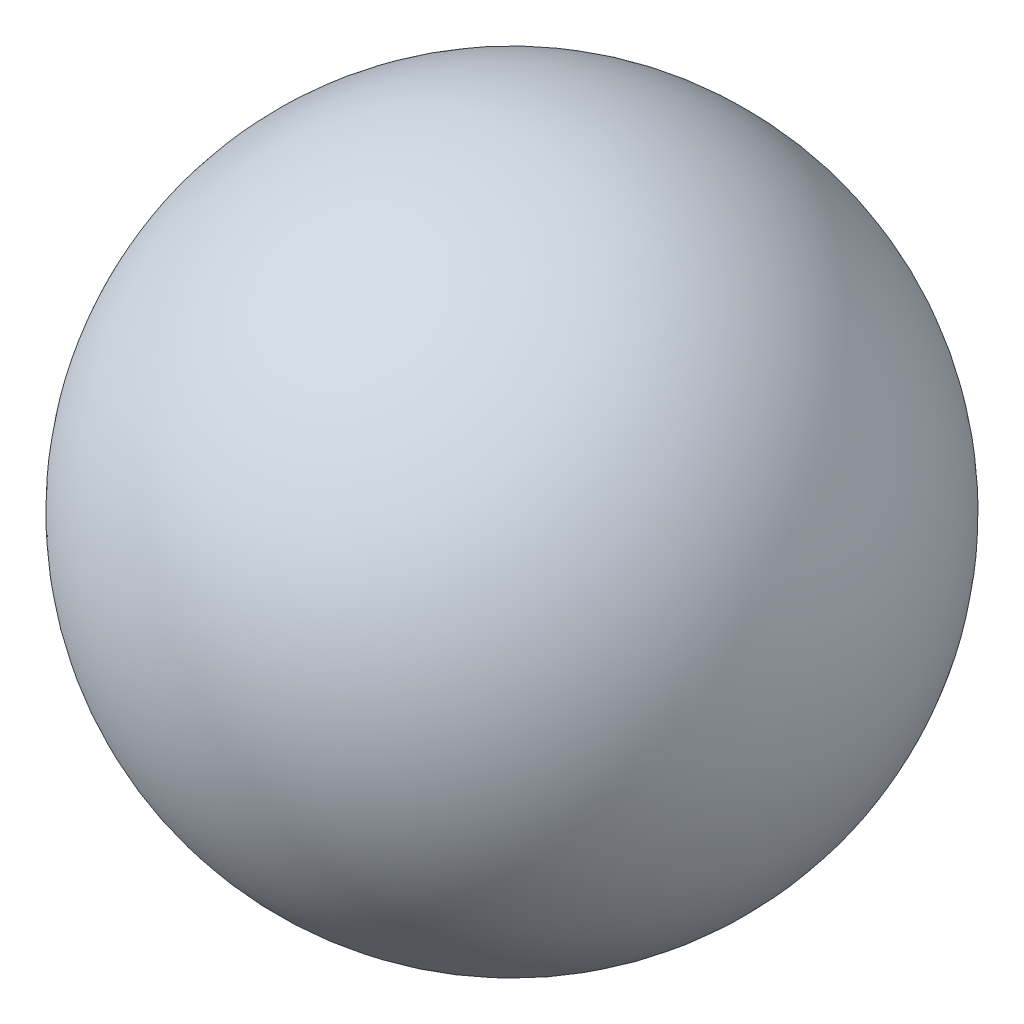
ISO-10303-21;
HEADER;
FILE_DESCRIPTION(('STEP AP214'),'2;1');
FILE_NAME('part.step','',(''),(''),'','','');
FILE_SCHEMA(('AUTOMOTIVE_DESIGN { 1 0 10303 214 1 1 1 1 }'));
ENDSEC;
DATA;
#1=APPLICATION_CONTEXT('core data for automotive mechanical design processes');
#2=APPLICATION_PROTOCOL_DEFINITION('international standard','automotive_design',2000,#1);
#3=PRODUCT_CONTEXT('',#1,'mechanical');
#4=PRODUCT('Part','Part','',(#3));
#5=PRODUCT_RELATED_PRODUCT_CATEGORY('part','',(#4));
#6=PRODUCT_DEFINITION_FORMATION('','',#4);
#7=PRODUCT_DEFINITION_CONTEXT('part definition',#1,'design');
#8=PRODUCT_DEFINITION('design','',#6,#7);
#9=PRODUCT_DEFINITION_SHAPE('','',#8);
#10=(LENGTH_UNIT() NAMED_UNIT(*) SI_UNIT(.MILLI.,.METRE.));
#11=(NAMED_UNIT(*) PLANE_ANGLE_UNIT() SI_UNIT($,.RADIAN.));
#12=(NAMED_UNIT(*) SI_UNIT($,.STERADIAN.) SOLID_ANGLE_UNIT());
#13=UNCERTAINTY_MEASURE_WITH_UNIT(LENGTH_MEASURE(1.E-05),#10,'distance_accuracy_value','');
#14=(GEOMETRIC_REPRESENTATION_CONTEXT(3) GLOBAL_UNCERTAINTY_ASSIGNED_CONTEXT((#13)) GLOBAL_UNIT_ASSIGNED_CONTEXT((#10,
#11,#12)) REPRESENTATION_CONTEXT('',''));
#15=CARTESIAN_POINT('',(0.,0.,0.));
#16=DIRECTION('',(0.,0.,1.));
#17=DIRECTION('',(1.,0.,0.));
#18=AXIS2_PLACEMENT_3D('',#15,#16,#17);
#19=CARTESIAN_POINT('',(2.,3.25,0.));
#20=DIRECTION('',(-1.,0.,0.));
#21=DIRECTION('',(0.,1.,0.));
#22=AXIS2_PLACEMENT_3D('',#19,#20,#21);
#23=SPHERICAL_SURFACE('',#22,1.25);
#24=CARTESIAN_POINT('',(0.75,3.25,0.));
#25=VERTEX_POINT('',#24);
#26=VERTEX_LOOP('',#25);
#27=FACE_BOUND('',#26,.T.);
#28=ADVANCED_FACE('F27',(#27),#23,.T.);
#29=CLOSED_SHELL('',(#28));
#30=MANIFOLD_SOLID_BREP('B2',#29);
#31=ADVANCED_BREP_SHAPE_REPRESENTATION('',(#18,#30),#14);
#32=SHAPE_DEFINITION_REPRESENTATION(#9,#31);
ENDSEC;
END-ISO-10303-21;
